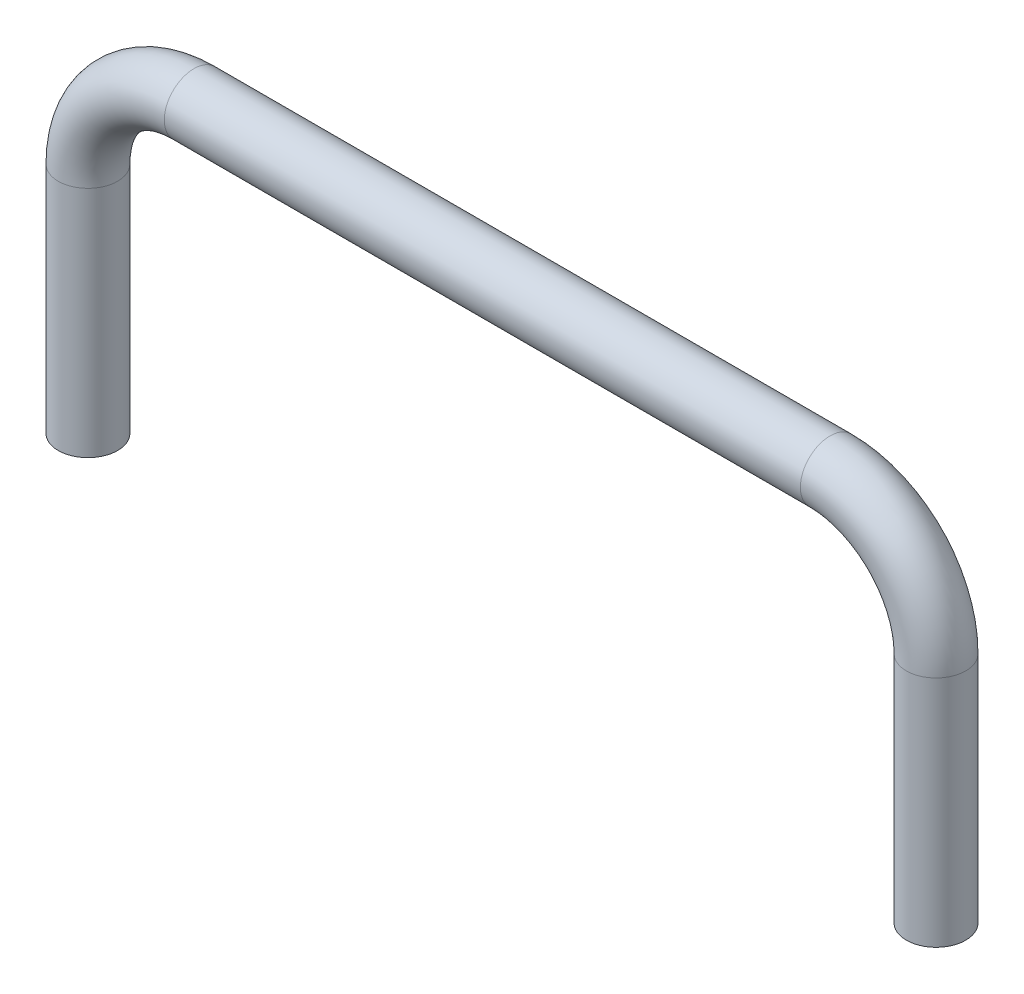
ISO-10303-21;
HEADER;
FILE_DESCRIPTION(('STEP AP214'),'2;1');
FILE_NAME('part.step','',(''),(''),'','','');
FILE_SCHEMA(('AUTOMOTIVE_DESIGN { 1 0 10303 214 1 1 1 1 }'));
ENDSEC;
DATA;
#1=APPLICATION_CONTEXT('core data for automotive mechanical design processes');
#2=APPLICATION_PROTOCOL_DEFINITION('international standard','automotive_design',2000,#1);
#3=PRODUCT_CONTEXT('',#1,'mechanical');
#4=PRODUCT('Part','Part','',(#3));
#5=PRODUCT_RELATED_PRODUCT_CATEGORY('part','',(#4));
#6=PRODUCT_DEFINITION_FORMATION('','',#4);
#7=PRODUCT_DEFINITION_CONTEXT('part definition',#1,'design');
#8=PRODUCT_DEFINITION('design','',#6,#7);
#9=PRODUCT_DEFINITION_SHAPE('','',#8);
#10=(LENGTH_UNIT() NAMED_UNIT(*) SI_UNIT(.MILLI.,.METRE.));
#11=(NAMED_UNIT(*) PLANE_ANGLE_UNIT() SI_UNIT($,.RADIAN.));
#12=(NAMED_UNIT(*) SI_UNIT($,.STERADIAN.) SOLID_ANGLE_UNIT());
#13=UNCERTAINTY_MEASURE_WITH_UNIT(LENGTH_MEASURE(1.E-05),#10,'distance_accuracy_value','');
#14=(GEOMETRIC_REPRESENTATION_CONTEXT(3) GLOBAL_UNCERTAINTY_ASSIGNED_CONTEXT((#13)) GLOBAL_UNIT_ASSIGNED_CONTEXT((#10,
#11,#12)) REPRESENTATION_CONTEXT('',''));
#15=CARTESIAN_POINT('',(0.,0.,0.));
#16=DIRECTION('',(0.,0.,1.));
#17=DIRECTION('',(1.,0.,0.));
#18=AXIS2_PLACEMENT_3D('',#15,#16,#17);
#19=CARTESIAN_POINT('',(0.,0.,0.));
#20=DIRECTION('',(0.,1.,0.));
#21=DIRECTION('',(0.,0.,1.));
#22=AXIS2_PLACEMENT_3D('',#19,#20,#21);
#23=PLANE('',#22);
#24=CARTESIAN_POINT('',(0.,0.,0.));
#25=DIRECTION('',(0.,1.,0.));
#26=DIRECTION('',(0.,0.,1.));
#27=AXIS2_PLACEMENT_3D('',#24,#25,#26);
#28=CIRCLE('',#27,0.7);
#29=CARTESIAN_POINT('',(0.,0.,0.7));
#30=VERTEX_POINT('',#29);
#31=EDGE_CURVE('E47',#30,#30,#28,.T.);
#32=ORIENTED_EDGE('',*,*,#31,.F.);
#33=EDGE_LOOP('',(#32));
#34=FACE_BOUND('',#33,.T.);
#35=ADVANCED_FACE('F35',(#34),#23,.F.);
#36=CARTESIAN_POINT('',(20.,0.,0.));
#37=DIRECTION('',(0.,-1.,0.));
#38=DIRECTION('',(0.,0.,1.));
#39=AXIS2_PLACEMENT_3D('',#36,#37,#38);
#40=PLANE('',#39);
#41=CARTESIAN_POINT('',(20.,0.,0.));
#42=DIRECTION('',(0.,-1.,0.));
#43=DIRECTION('',(0.,0.,1.));
#44=AXIS2_PLACEMENT_3D('',#41,#42,#43);
#45=CIRCLE('',#44,0.7);
#46=CARTESIAN_POINT('',(20.,0.,0.7));
#47=VERTEX_POINT('',#46);
#48=EDGE_CURVE('E11',#47,#47,#45,.T.);
#49=ORIENTED_EDGE('',*,*,#48,.T.);
#50=EDGE_LOOP('',(#49));
#51=FACE_BOUND('',#50,.T.);
#52=ADVANCED_FACE('F50',(#51),#40,.T.);
#53=CARTESIAN_POINT('',(0.,0.,0.));
#54=DIRECTION('',(0.,1.,0.));
#55=DIRECTION('',(0.,0.,1.));
#56=AXIS2_PLACEMENT_3D('',#53,#54,#55);
#57=CYLINDRICAL_SURFACE('',#56,0.7);
#58=CARTESIAN_POINT('',(0.,5.5,0.));
#59=DIRECTION('',(0.,1.,0.));
#60=DIRECTION('',(0.,0.,1.));
#61=AXIS2_PLACEMENT_3D('',#58,#59,#60);
#62=CIRCLE('',#61,0.7);
#63=CARTESIAN_POINT('',(-0.7,5.5,0.));
#64=VERTEX_POINT('',#63);
#65=EDGE_CURVE('E67',#64,#64,#62,.T.);
#66=ORIENTED_EDGE('',*,*,#65,.F.);
#67=EDGE_LOOP('',(#66));
#68=FACE_BOUND('',#67,.T.);
#69=ORIENTED_EDGE('',*,*,#31,.T.);
#70=EDGE_LOOP('',(#69));
#71=FACE_BOUND('',#70,.T.);
#72=ADVANCED_FACE('F71',(#68,#71),#57,.T.);
#73=CARTESIAN_POINT('',(2.5,5.5,0.));
#74=DIRECTION('',(0.,0.,-1.));
#75=DIRECTION('',(-1.,0.,0.));
#76=AXIS2_PLACEMENT_3D('',#73,#74,#75);
#77=TOROIDAL_SURFACE('',#76,2.5,0.7);
#78=CARTESIAN_POINT('',(2.5,8.,0.));
#79=DIRECTION('',(1.,0.,0.));
#80=DIRECTION('',(0.,0.,1.));
#81=AXIS2_PLACEMENT_3D('',#78,#79,#80);
#82=CIRCLE('',#81,0.7);
#83=CARTESIAN_POINT('',(2.5,8.7,0.));
#84=VERTEX_POINT('',#83);
#85=EDGE_CURVE('E62',#84,#84,#82,.T.);
#86=CARTESIAN_POINT('',(2.5,5.5,0.));
#87=DIRECTION('',(0.,0.,-1.));
#88=DIRECTION('',(-1.,0.,0.));
#89=AXIS2_PLACEMENT_3D('',#86,#87,#88);
#90=CIRCLE('',#89,3.2);
#91=EDGE_CURVE('',#64,#84,#90,.T.);
#92=ORIENTED_EDGE('',*,*,#65,.T.);
#93=ORIENTED_EDGE('',*,*,#85,.F.);
#94=ORIENTED_EDGE('',*,*,#91,.T.);
#95=ORIENTED_EDGE('',*,*,#91,.F.);
#96=EDGE_LOOP('',(#92,#94,#93,#95));
#97=FACE_BOUND('',#96,.T.);
#98=ADVANCED_FACE('F73',(#97),#77,.T.);
#99=CARTESIAN_POINT('',(2.5,8.,0.));
#100=DIRECTION('',(1.,0.,0.));
#101=DIRECTION('',(0.,0.,-1.));
#102=AXIS2_PLACEMENT_3D('',#99,#100,#101);
#103=CYLINDRICAL_SURFACE('',#102,0.7);
#104=CARTESIAN_POINT('',(17.5,8.,0.));
#105=DIRECTION('',(1.,0.,0.));
#106=DIRECTION('',(0.,0.,1.));
#107=AXIS2_PLACEMENT_3D('',#104,#105,#106);
#108=CIRCLE('',#107,0.7);
#109=CARTESIAN_POINT('',(17.5,8.7,0.));
#110=VERTEX_POINT('',#109);
#111=EDGE_CURVE('E60',#110,#110,#108,.T.);
#112=ORIENTED_EDGE('',*,*,#111,.F.);
#113=EDGE_LOOP('',(#112));
#114=FACE_BOUND('',#113,.T.);
#115=ORIENTED_EDGE('',*,*,#85,.T.);
#116=EDGE_LOOP('',(#115));
#117=FACE_BOUND('',#116,.T.);
#118=ADVANCED_FACE('F80',(#114,#117),#103,.T.);
#119=CARTESIAN_POINT('',(17.5,5.5,0.));
#120=DIRECTION('',(0.,0.,-1.));
#121=DIRECTION('',(-1.,0.,0.));
#122=AXIS2_PLACEMENT_3D('',#119,#120,#121);
#123=TOROIDAL_SURFACE('',#122,2.5,0.7);
#124=CARTESIAN_POINT('',(20.,5.5,0.));
#125=DIRECTION('',(0.,-1.,0.));
#126=DIRECTION('',(0.,0.,1.));
#127=AXIS2_PLACEMENT_3D('',#124,#125,#126);
#128=CIRCLE('',#127,0.7);
#129=CARTESIAN_POINT('',(20.7,5.5,0.));
#130=VERTEX_POINT('',#129);
#131=EDGE_CURVE('E42',#130,#130,#128,.T.);
#132=CARTESIAN_POINT('',(17.5,5.5,0.));
#133=DIRECTION('',(0.,0.,-1.));
#134=DIRECTION('',(-1.,0.,0.));
#135=AXIS2_PLACEMENT_3D('',#132,#133,#134);
#136=CIRCLE('',#135,3.2);
#137=EDGE_CURVE('',#110,#130,#136,.T.);
#138=ORIENTED_EDGE('',*,*,#111,.T.);
#139=ORIENTED_EDGE('',*,*,#131,.F.);
#140=ORIENTED_EDGE('',*,*,#137,.T.);
#141=ORIENTED_EDGE('',*,*,#137,.F.);
#142=EDGE_LOOP('',(#138,#140,#139,#141));
#143=FACE_BOUND('',#142,.T.);
#144=ADVANCED_FACE('F55',(#143),#123,.T.);
#145=CARTESIAN_POINT('',(20.,5.5,0.));
#146=DIRECTION('',(0.,-1.,0.));
#147=DIRECTION('',(0.,0.,-1.));
#148=AXIS2_PLACEMENT_3D('',#145,#146,#147);
#149=CYLINDRICAL_SURFACE('',#148,0.7);
#150=ORIENTED_EDGE('',*,*,#48,.F.);
#151=EDGE_LOOP('',(#150));
#152=FACE_BOUND('',#151,.T.);
#153=ORIENTED_EDGE('',*,*,#131,.T.);
#154=EDGE_LOOP('',(#153));
#155=FACE_BOUND('',#154,.T.);
#156=ADVANCED_FACE('F52',(#152,#155),#149,.T.);
#157=CLOSED_SHELL('',(#35,#52,#72,#98,#118,#144,#156));
#158=MANIFOLD_SOLID_BREP('B2',#157);
#159=ADVANCED_BREP_SHAPE_REPRESENTATION('',(#18,#158),#14);
#160=SHAPE_DEFINITION_REPRESENTATION(#9,#159);
ENDSEC;
END-ISO-10303-21;
